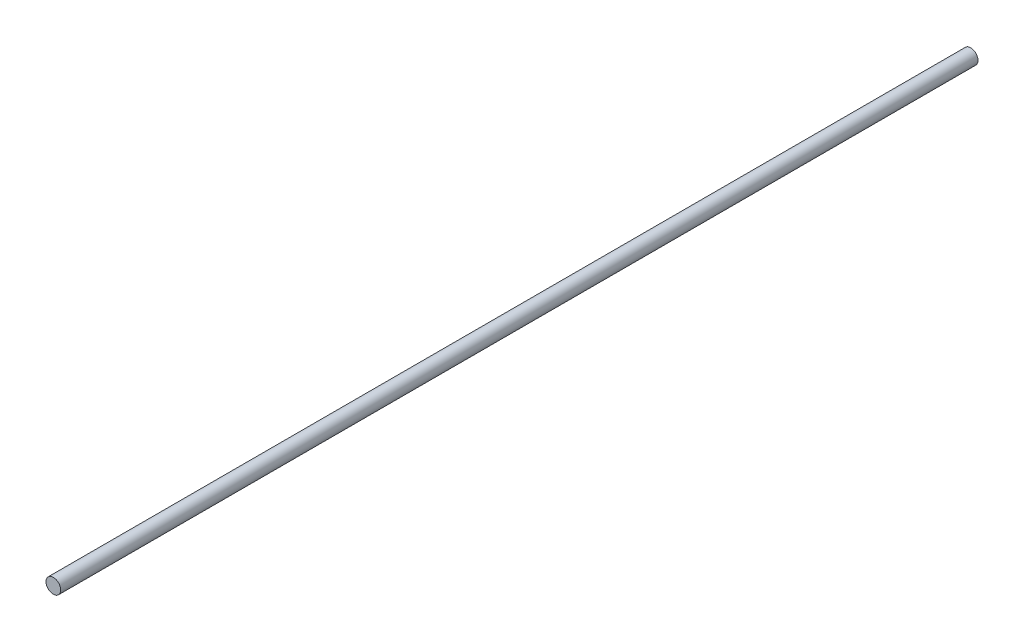
ISO-10303-21;
HEADER;
FILE_DESCRIPTION(('STEP AP214'),'2;1');
FILE_NAME('part.step','',(''),(''),'','','');
FILE_SCHEMA(('AUTOMOTIVE_DESIGN { 1 0 10303 214 1 1 1 1 }'));
ENDSEC;
DATA;
#1=APPLICATION_CONTEXT('core data for automotive mechanical design processes');
#2=APPLICATION_PROTOCOL_DEFINITION('international standard','automotive_design',2000,#1);
#3=PRODUCT_CONTEXT('',#1,'mechanical');
#4=PRODUCT('Part','Part','',(#3));
#5=PRODUCT_RELATED_PRODUCT_CATEGORY('part','',(#4));
#6=PRODUCT_DEFINITION_FORMATION('','',#4);
#7=PRODUCT_DEFINITION_CONTEXT('part definition',#1,'design');
#8=PRODUCT_DEFINITION('design','',#6,#7);
#9=PRODUCT_DEFINITION_SHAPE('','',#8);
#10=(LENGTH_UNIT() NAMED_UNIT(*) SI_UNIT(.MILLI.,.METRE.));
#11=(NAMED_UNIT(*) PLANE_ANGLE_UNIT() SI_UNIT($,.RADIAN.));
#12=(NAMED_UNIT(*) SI_UNIT($,.STERADIAN.) SOLID_ANGLE_UNIT());
#13=UNCERTAINTY_MEASURE_WITH_UNIT(LENGTH_MEASURE(1.E-05),#10,'distance_accuracy_value','');
#14=(GEOMETRIC_REPRESENTATION_CONTEXT(3) GLOBAL_UNCERTAINTY_ASSIGNED_CONTEXT((#13)) GLOBAL_UNIT_ASSIGNED_CONTEXT((#10,
#11,#12)) REPRESENTATION_CONTEXT('',''));
#15=CARTESIAN_POINT('',(0.,0.,0.));
#16=DIRECTION('',(0.,0.,1.));
#17=DIRECTION('',(1.,0.,0.));
#18=AXIS2_PLACEMENT_3D('',#15,#16,#17);
#19=CARTESIAN_POINT('',(0.,0.,-500.));
#20=DIRECTION('',(0.,0.,1.));
#21=DIRECTION('',(1.,0.,0.));
#22=AXIS2_PLACEMENT_3D('',#19,#20,#21);
#23=CYLINDRICAL_SURFACE('',#22,4.);
#24=DIRECTION('',(0.,0.,1.));
#25=VECTOR('',#24,1.);
#26=CARTESIAN_POINT('',(-3.,2.64575131106459,-500.));
#27=LINE('',#26,#25);
#28=CARTESIAN_POINT('',(-3.,2.64575131106459,-490.));
#29=VERTEX_POINT('',#28);
#30=CARTESIAN_POINT('',(-3.,2.64575131106459,-500.));
#31=VERTEX_POINT('',#30);
#32=EDGE_CURVE('E47',#29,#31,#27,.F.);
#33=ORIENTED_EDGE('',*,*,#32,.F.);
#34=CARTESIAN_POINT('',(0.,0.,-490.));
#35=DIRECTION('',(0.,0.,-1.));
#36=DIRECTION('',(-1.,0.,0.));
#37=AXIS2_PLACEMENT_3D('',#34,#35,#36);
#38=CIRCLE('',#37,4.);
#39=CARTESIAN_POINT('',(-3.,-2.64575131106459,-490.));
#40=VERTEX_POINT('',#39);
#41=EDGE_CURVE('E11',#29,#40,#38,.F.);
#42=ORIENTED_EDGE('',*,*,#41,.T.);
#43=DIRECTION('',(0.,0.,1.));
#44=VECTOR('',#43,1.);
#45=CARTESIAN_POINT('',(-3.,-2.64575131106459,-500.));
#46=LINE('',#45,#44);
#47=CARTESIAN_POINT('',(-3.,-2.64575131106459,-500.));
#48=VERTEX_POINT('',#47);
#49=EDGE_CURVE('E52',#48,#40,#46,.T.);
#50=ORIENTED_EDGE('',*,*,#49,.F.);
#51=CARTESIAN_POINT('',(0.,0.,-500.));
#52=DIRECTION('',(0.,0.,1.));
#53=DIRECTION('',(1.,0.,0.));
#54=AXIS2_PLACEMENT_3D('',#51,#52,#53);
#55=CIRCLE('',#54,4.);
#56=EDGE_CURVE('E62',#48,#31,#55,.T.);
#57=ORIENTED_EDGE('',*,*,#56,.T.);
#58=EDGE_LOOP('',(#33,#42,#50,#57));
#59=FACE_BOUND('',#58,.T.);
#60=CARTESIAN_POINT('',(0.,0.,0.));
#61=DIRECTION('',(0.,0.,1.));
#62=DIRECTION('',(1.,0.,0.));
#63=AXIS2_PLACEMENT_3D('',#60,#61,#62);
#64=CIRCLE('',#63,4.);
#65=CARTESIAN_POINT('',(4.,0.,0.));
#66=VERTEX_POINT('',#65);
#67=EDGE_CURVE('E68',#66,#66,#64,.T.);
#68=ORIENTED_EDGE('',*,*,#67,.F.);
#69=EDGE_LOOP('',(#68));
#70=FACE_BOUND('',#69,.T.);
#71=ADVANCED_FACE('F33',(#59,#70),#23,.T.);
#72=CARTESIAN_POINT('',(0.,0.,-500.));
#73=DIRECTION('',(0.,0.,1.));
#74=DIRECTION('',(1.,0.,0.));
#75=AXIS2_PLACEMENT_3D('',#72,#73,#74);
#76=PLANE('',#75);
#77=ORIENTED_EDGE('',*,*,#56,.F.);
#78=DIRECTION('',(0.,1.,0.));
#79=VECTOR('',#78,1.);
#80=CARTESIAN_POINT('',(-3.,0.,-500.));
#81=LINE('',#80,#79);
#82=EDGE_CURVE('E40',#48,#31,#81,.T.);
#83=ORIENTED_EDGE('',*,*,#82,.T.);
#84=EDGE_LOOP('',(#77,#83));
#85=FACE_BOUND('',#84,.T.);
#86=ADVANCED_FACE('F67',(#85),#76,.F.);
#87=CARTESIAN_POINT('',(0.,0.,0.));
#88=DIRECTION('',(0.,0.,1.));
#89=DIRECTION('',(1.,0.,0.));
#90=AXIS2_PLACEMENT_3D('',#87,#88,#89);
#91=PLANE('',#90);
#92=ORIENTED_EDGE('',*,*,#67,.T.);
#93=EDGE_LOOP('',(#92));
#94=FACE_BOUND('',#93,.T.);
#95=ADVANCED_FACE('F81',(#94),#91,.T.);
#96=CARTESIAN_POINT('',(-3.,6.40494866765136,-490.));
#97=DIRECTION('',(1.,0.,0.));
#98=DIRECTION('',(0.,1.,0.));
#99=AXIS2_PLACEMENT_3D('',#96,#97,#98);
#100=PLANE('',#99);
#101=ORIENTED_EDGE('',*,*,#32,.T.);
#102=ORIENTED_EDGE('',*,*,#82,.F.);
#103=ORIENTED_EDGE('',*,*,#49,.T.);
#104=DIRECTION('',(0.,-1.,0.));
#105=VECTOR('',#104,1.);
#106=CARTESIAN_POINT('',(-3.,6.40494866765136,-490.));
#107=LINE('',#106,#105);
#108=EDGE_CURVE('E65',#29,#40,#107,.T.);
#109=ORIENTED_EDGE('',*,*,#108,.F.);
#110=EDGE_LOOP('',(#101,#102,#103,#109));
#111=FACE_BOUND('',#110,.T.);
#112=ADVANCED_FACE('F58',(#111),#100,.F.);
#113=CARTESIAN_POINT('',(0.,0.,-490.));
#114=DIRECTION('',(0.,0.,-1.));
#115=DIRECTION('',(-1.,0.,0.));
#116=AXIS2_PLACEMENT_3D('',#113,#114,#115);
#117=PLANE('',#116);
#118=ORIENTED_EDGE('',*,*,#108,.T.);
#119=ORIENTED_EDGE('',*,*,#41,.F.);
#120=EDGE_LOOP('',(#118,#119));
#121=FACE_BOUND('',#120,.T.);
#122=ADVANCED_FACE('F75',(#121),#117,.T.);
#123=CLOSED_SHELL('',(#71,#86,#95,#112,#122));
#124=MANIFOLD_SOLID_BREP('B2',#123);
#125=ADVANCED_BREP_SHAPE_REPRESENTATION('',(#18,#124),#14);
#126=SHAPE_DEFINITION_REPRESENTATION(#9,#125);
ENDSEC;
END-ISO-10303-21;
